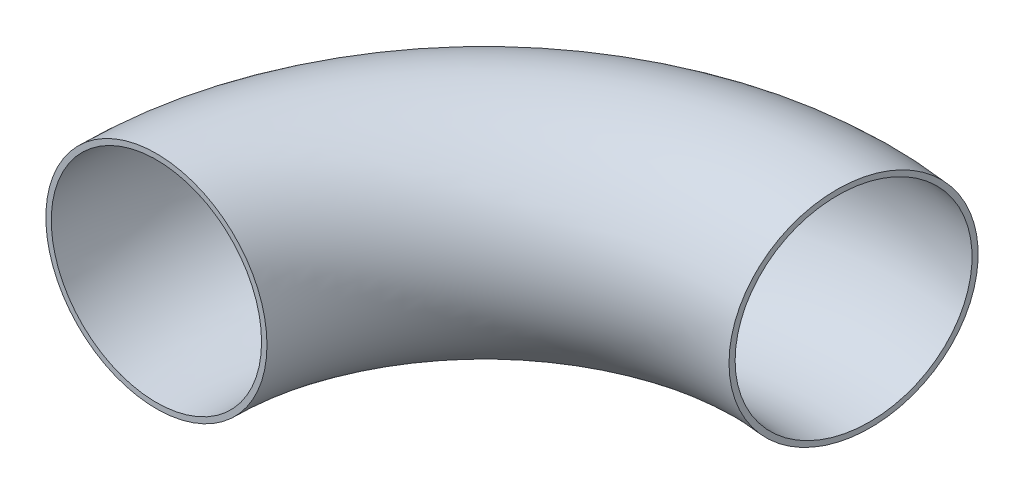
ISO-10303-21;
HEADER;
FILE_DESCRIPTION(('STEP AP214'),'2;1');
FILE_NAME('part.step','',(''),(''),'','','');
FILE_SCHEMA(('AUTOMOTIVE_DESIGN { 1 0 10303 214 1 1 1 1 }'));
ENDSEC;
DATA;
#1=APPLICATION_CONTEXT('core data for automotive mechanical design processes');
#2=APPLICATION_PROTOCOL_DEFINITION('international standard','automotive_design',2000,#1);
#3=PRODUCT_CONTEXT('',#1,'mechanical');
#4=PRODUCT('Part','Part','',(#3));
#5=PRODUCT_RELATED_PRODUCT_CATEGORY('part','',(#4));
#6=PRODUCT_DEFINITION_FORMATION('','',#4);
#7=PRODUCT_DEFINITION_CONTEXT('part definition',#1,'design');
#8=PRODUCT_DEFINITION('design','',#6,#7);
#9=PRODUCT_DEFINITION_SHAPE('','',#8);
#10=(LENGTH_UNIT() NAMED_UNIT(*) SI_UNIT(.MILLI.,.METRE.));
#11=(NAMED_UNIT(*) PLANE_ANGLE_UNIT() SI_UNIT($,.RADIAN.));
#12=(NAMED_UNIT(*) SI_UNIT($,.STERADIAN.) SOLID_ANGLE_UNIT());
#13=UNCERTAINTY_MEASURE_WITH_UNIT(LENGTH_MEASURE(1.E-05),#10,'distance_accuracy_value','');
#14=(GEOMETRIC_REPRESENTATION_CONTEXT(3) GLOBAL_UNCERTAINTY_ASSIGNED_CONTEXT((#13)) GLOBAL_UNIT_ASSIGNED_CONTEXT((#10,
#11,#12)) REPRESENTATION_CONTEXT('',''));
#15=CARTESIAN_POINT('',(0.,0.,0.));
#16=DIRECTION('',(0.,0.,1.));
#17=DIRECTION('',(1.,0.,0.));
#18=AXIS2_PLACEMENT_3D('',#15,#16,#17);
#19=CARTESIAN_POINT('',(75.3070805093088,0.,9.45113223793648E-07));
#20=DIRECTION('',(0.,1.,0.));
#21=DIRECTION('',(0.,0.,1.));
#22=AXIS2_PLACEMENT_3D('',#19,#20,#21);
#23=TOROIDAL_SURFACE('',#22,75.3070805093088,24.1554);
#24=CARTESIAN_POINT('',(85.5532085551616,0.,-74.6067898644606));
#25=DIRECTION('',(-0.990700880097745,0.,-0.136057951526375));
#26=DIRECTION('',(-0.136057951526375,0.,0.990700880097745));
#27=AXIS2_PLACEMENT_3D('',#24,#25,#26);
#28=CIRCLE('',#27,24.1554);
#29=CARTESIAN_POINT('',(82.2666743128615,0.,-50.6760138253475));
#30=VERTEX_POINT('',#29);
#31=EDGE_CURVE('E40',#30,#30,#28,.T.);
#32=ORIENTED_EDGE('',*,*,#31,.F.);
#33=EDGE_LOOP('',(#32));
#34=FACE_BOUND('',#33,.T.);
#35=CARTESIAN_POINT('',(0.,0.,0.));
#36=DIRECTION('',(0.,0.,1.));
#37=DIRECTION('',(1.,0.,0.));
#38=AXIS2_PLACEMENT_3D('',#35,#36,#37);
#39=CIRCLE('',#38,24.1554);
#40=CARTESIAN_POINT('',(24.1554,0.,0.));
#41=VERTEX_POINT('',#40);
#42=EDGE_CURVE('E48',#41,#41,#39,.T.);
#43=ORIENTED_EDGE('',*,*,#42,.T.);
#44=EDGE_LOOP('',(#43));
#45=FACE_BOUND('',#44,.T.);
#46=ADVANCED_FACE('F33',(#34,#45),#23,.F.);
#47=CARTESIAN_POINT('',(75.3070805093088,0.,9.45113223793648E-07));
#48=DIRECTION('',(0.,1.,0.));
#49=DIRECTION('',(0.,0.,1.));
#50=AXIS2_PLACEMENT_3D('',#47,#48,#49);
#51=TOROIDAL_SURFACE('',#50,75.3070805093088,25.4);
#52=CARTESIAN_POINT('',(85.5532085551616,0.,-74.6067898644606));
#53=DIRECTION('',(-0.990700880097745,0.,-0.136057951526375));
#54=DIRECTION('',(-0.136057951526375,0.,0.990700880097745));
#55=AXIS2_PLACEMENT_3D('',#52,#53,#54);
#56=CIRCLE('',#55,25.4);
#57=CARTESIAN_POINT('',(82.0973365863917,0.,-49.4429875099779));
#58=VERTEX_POINT('',#57);
#59=EDGE_CURVE('E10',#58,#58,#56,.T.);
#60=ORIENTED_EDGE('',*,*,#59,.T.);
#61=EDGE_LOOP('',(#60));
#62=FACE_BOUND('',#61,.T.);
#63=CARTESIAN_POINT('',(0.,0.,0.));
#64=DIRECTION('',(0.,0.,1.));
#65=DIRECTION('',(1.,0.,0.));
#66=AXIS2_PLACEMENT_3D('',#63,#64,#65);
#67=CIRCLE('',#66,25.4);
#68=CARTESIAN_POINT('',(25.4,0.,0.));
#69=VERTEX_POINT('',#68);
#70=EDGE_CURVE('E44',#69,#69,#67,.T.);
#71=ORIENTED_EDGE('',*,*,#70,.F.);
#72=EDGE_LOOP('',(#71));
#73=FACE_BOUND('',#72,.T.);
#74=ADVANCED_FACE('F35',(#62,#73),#51,.T.);
#75=CARTESIAN_POINT('',(85.5532085551616,0.,-74.6067898644606));
#76=DIRECTION('',(-0.990700880097745,0.,-0.136057951526375));
#77=DIRECTION('',(-0.136057951526375,0.,0.990700880097745));
#78=AXIS2_PLACEMENT_3D('',#75,#76,#77);
#79=PLANE('',#78);
#80=ORIENTED_EDGE('',*,*,#31,.T.);
#81=EDGE_LOOP('',(#80));
#82=FACE_BOUND('',#81,.T.);
#83=ORIENTED_EDGE('',*,*,#59,.F.);
#84=EDGE_LOOP('',(#83));
#85=FACE_BOUND('',#84,.T.);
#86=ADVANCED_FACE('F58',(#82,#85),#79,.F.);
#87=CARTESIAN_POINT('',(0.,0.,0.));
#88=DIRECTION('',(0.,0.,1.));
#89=DIRECTION('',(1.,0.,0.));
#90=AXIS2_PLACEMENT_3D('',#87,#88,#89);
#91=PLANE('',#90);
#92=ORIENTED_EDGE('',*,*,#42,.F.);
#93=EDGE_LOOP('',(#92));
#94=FACE_BOUND('',#93,.T.);
#95=ORIENTED_EDGE('',*,*,#70,.T.);
#96=EDGE_LOOP('',(#95));
#97=FACE_BOUND('',#96,.T.);
#98=ADVANCED_FACE('F55',(#94,#97),#91,.T.);
#99=CLOSED_SHELL('',(#46,#74,#86,#98));
#100=MANIFOLD_SOLID_BREP('B2',#99);
#101=ADVANCED_BREP_SHAPE_REPRESENTATION('',(#18,#100),#14);
#102=SHAPE_DEFINITION_REPRESENTATION(#9,#101);
ENDSEC;
END-ISO-10303-21;
